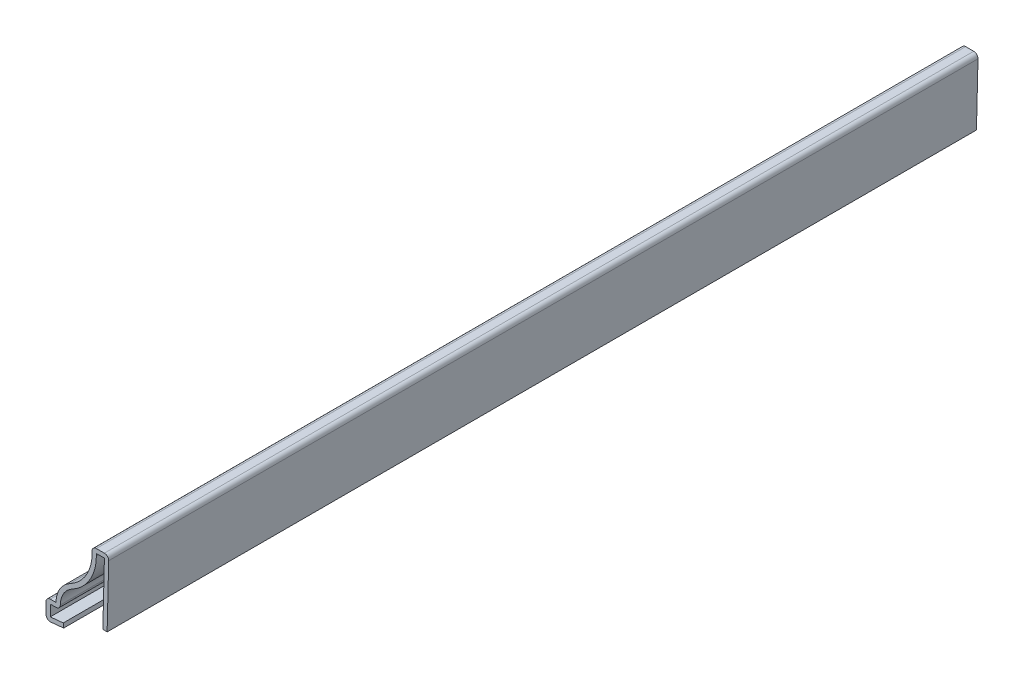
ISO-10303-21;
HEADER;
FILE_DESCRIPTION(('STEP AP214'),'2;1');
FILE_NAME('part.step','',(''),(''),'','','');
FILE_SCHEMA(('AUTOMOTIVE_DESIGN { 1 0 10303 214 1 1 1 1 }'));
ENDSEC;
DATA;
#1=APPLICATION_CONTEXT('core data for automotive mechanical design processes');
#2=APPLICATION_PROTOCOL_DEFINITION('international standard','automotive_design',2000,#1);
#3=PRODUCT_CONTEXT('',#1,'mechanical');
#4=PRODUCT('Part','Part','',(#3));
#5=PRODUCT_RELATED_PRODUCT_CATEGORY('part','',(#4));
#6=PRODUCT_DEFINITION_FORMATION('','',#4);
#7=PRODUCT_DEFINITION_CONTEXT('part definition',#1,'design');
#8=PRODUCT_DEFINITION('design','',#6,#7);
#9=PRODUCT_DEFINITION_SHAPE('','',#8);
#10=(LENGTH_UNIT() NAMED_UNIT(*) SI_UNIT(.MILLI.,.METRE.));
#11=(NAMED_UNIT(*) PLANE_ANGLE_UNIT() SI_UNIT($,.RADIAN.));
#12=(NAMED_UNIT(*) SI_UNIT($,.STERADIAN.) SOLID_ANGLE_UNIT());
#13=UNCERTAINTY_MEASURE_WITH_UNIT(LENGTH_MEASURE(1.E-05),#10,'distance_accuracy_value','');
#14=(GEOMETRIC_REPRESENTATION_CONTEXT(3) GLOBAL_UNCERTAINTY_ASSIGNED_CONTEXT((#13)) GLOBAL_UNIT_ASSIGNED_CONTEXT((#10,
#11,#12)) REPRESENTATION_CONTEXT('',''));
#15=CARTESIAN_POINT('',(0.,0.,0.));
#16=DIRECTION('',(0.,0.,1.));
#17=DIRECTION('',(1.,0.,0.));
#18=AXIS2_PLACEMENT_3D('',#15,#16,#17);
#19=CARTESIAN_POINT('',(-1.01568264875065,20.6628920662188,-206.375));
#20=DIRECTION('',(-0.999687646408123,0.0249921911602029,0.));
#21=DIRECTION('',(-0.0249921911602029,-0.999687646408123,0.));
#22=AXIS2_PLACEMENT_3D('',#19,#20,#21);
#23=PLANE('',#22);
#24=DIRECTION('',(-0.0249921911602029,-0.999687646408123,0.));
#25=VECTOR('',#24,1.);
#26=CARTESIAN_POINT('',(-1.01568264875065,20.6628920662188,0.));
#27=LINE('',#26,#25);
#28=CARTESIAN_POINT('',(-1.04171745040612,19.6215,0.));
#29=VERTEX_POINT('',#28);
#30=CARTESIAN_POINT('',(-1.41255764875065,4.78789206621876,0.));
#31=VERTEX_POINT('',#30);
#32=EDGE_CURVE('E259',#29,#31,#27,.T.);
#33=ORIENTED_EDGE('',*,*,#32,.F.);
#34=DIRECTION('',(0.,0.,1.));
#35=VECTOR('',#34,1.);
#36=CARTESIAN_POINT('',(-1.04171745040612,19.6215,-206.375));
#37=LINE('',#36,#35);
#38=CARTESIAN_POINT('',(-1.04171745040612,19.6215,-206.375));
#39=VERTEX_POINT('',#38);
#40=EDGE_CURVE('E215',#39,#29,#37,.T.);
#41=ORIENTED_EDGE('',*,*,#40,.F.);
#42=DIRECTION('',(-0.0249921911602029,-0.999687646408123,0.));
#43=VECTOR('',#42,1.);
#44=CARTESIAN_POINT('',(-1.01568264875065,20.6628920662188,-206.375));
#45=LINE('',#44,#43);
#46=CARTESIAN_POINT('',(-1.41255764875065,4.78789206621876,-206.375));
#47=VERTEX_POINT('',#46);
#48=EDGE_CURVE('E197',#39,#47,#45,.T.);
#49=ORIENTED_EDGE('',*,*,#48,.T.);
#50=DIRECTION('',(0.,0.,1.));
#51=VECTOR('',#50,1.);
#52=CARTESIAN_POINT('',(-1.41255764875065,4.78789206621876,-206.375));
#53=LINE('',#52,#51);
#54=EDGE_CURVE('E205',#47,#31,#53,.T.);
#55=ORIENTED_EDGE('',*,*,#54,.T.);
#56=EDGE_LOOP('',(#33,#41,#49,#55));
#57=FACE_BOUND('',#56,.T.);
#58=ADVANCED_FACE('F35',(#57),#23,.T.);
#59=CARTESIAN_POINT('',(0.,19.6215,-206.375));
#60=DIRECTION('',(0.,-1.,0.));
#61=DIRECTION('',(0.,0.,-1.));
#62=AXIS2_PLACEMENT_3D('',#59,#60,#61);
#63=PLANE('',#62);
#64=DIRECTION('',(1.,0.,0.));
#65=VECTOR('',#64,1.);
#66=CARTESIAN_POINT('',(0.,19.6215,0.));
#67=LINE('',#66,#65);
#68=CARTESIAN_POINT('',(-2.95275,19.6215,0.));
#69=VERTEX_POINT('',#68);
#70=EDGE_CURVE('E216',#69,#29,#67,.T.);
#71=ORIENTED_EDGE('',*,*,#70,.F.);
#72=DIRECTION('',(0.,0.,1.));
#73=VECTOR('',#72,1.);
#74=CARTESIAN_POINT('',(-2.95275,19.6215,-206.375));
#75=LINE('',#74,#73);
#76=CARTESIAN_POINT('',(-2.95275,19.6215,-206.375));
#77=VERTEX_POINT('',#76);
#78=EDGE_CURVE('E301',#77,#69,#75,.T.);
#79=ORIENTED_EDGE('',*,*,#78,.F.);
#80=DIRECTION('',(1.,0.,0.));
#81=VECTOR('',#80,1.);
#82=CARTESIAN_POINT('',(0.,19.6215,-206.375));
#83=LINE('',#82,#81);
#84=EDGE_CURVE('E213',#77,#39,#83,.T.);
#85=ORIENTED_EDGE('',*,*,#84,.T.);
#86=ORIENTED_EDGE('',*,*,#40,.T.);
#87=EDGE_LOOP('',(#71,#79,#85,#86));
#88=FACE_BOUND('',#87,.T.);
#89=ADVANCED_FACE('F387',(#88),#63,.T.);
#90=CARTESIAN_POINT('',(-2.95275,20.6375,-206.375));
#91=DIRECTION('',(1.,0.,0.));
#92=DIRECTION('',(0.,0.,-1.));
#93=AXIS2_PLACEMENT_3D('',#90,#91,#92);
#94=PLANE('',#93);
#95=DIRECTION('',(0.,1.,0.));
#96=VECTOR('',#95,1.);
#97=CARTESIAN_POINT('',(-2.95275,20.6375,0.));
#98=LINE('',#97,#96);
#99=CARTESIAN_POINT('',(-2.95275,19.05,0.));
#100=VERTEX_POINT('',#99);
#101=EDGE_CURVE('E219',#100,#69,#98,.T.);
#102=ORIENTED_EDGE('',*,*,#101,.F.);
#103=DIRECTION('',(0.,0.,1.));
#104=VECTOR('',#103,1.);
#105=CARTESIAN_POINT('',(-2.95275,19.05,-206.375));
#106=LINE('',#105,#104);
#107=CARTESIAN_POINT('',(-2.95275,19.05,-206.375));
#108=VERTEX_POINT('',#107);
#109=EDGE_CURVE('E303',#108,#100,#106,.T.);
#110=ORIENTED_EDGE('',*,*,#109,.F.);
#111=DIRECTION('',(0.,1.,0.));
#112=VECTOR('',#111,1.);
#113=CARTESIAN_POINT('',(-2.95275,20.6375,-206.375));
#114=LINE('',#113,#112);
#115=EDGE_CURVE('E255',#108,#77,#114,.T.);
#116=ORIENTED_EDGE('',*,*,#115,.T.);
#117=ORIENTED_EDGE('',*,*,#78,.T.);
#118=EDGE_LOOP('',(#102,#110,#116,#117));
#119=FACE_BOUND('',#118,.T.);
#120=ADVANCED_FACE('F463',(#119),#94,.T.);
#121=CARTESIAN_POINT('',(-13.890625,19.05,-206.375));
#122=DIRECTION('',(0.,0.,1.));
#123=DIRECTION('',(1.,0.,0.));
#124=AXIS2_PLACEMENT_3D('',#121,#122,#123);
#125=CYLINDRICAL_SURFACE('',#124,10.937875);
#126=CARTESIAN_POINT('',(-13.890625,19.05,0.));
#127=DIRECTION('',(0.,0.,1.));
#128=DIRECTION('',(1.,0.,0.));
#129=AXIS2_PLACEMENT_3D('',#126,#127,#128);
#130=CIRCLE('',#129,10.937875);
#131=CARTESIAN_POINT('',(-8.70447158536586,9.41979116137643,0.));
#132=VERTEX_POINT('',#131);
#133=EDGE_CURVE('E294',#132,#100,#130,.T.);
#134=ORIENTED_EDGE('',*,*,#133,.F.);
#135=DIRECTION('',(0.,0.,1.));
#136=VECTOR('',#135,1.);
#137=CARTESIAN_POINT('',(-8.70447158536586,9.41979116137643,-206.375));
#138=LINE('',#137,#136);
#139=CARTESIAN_POINT('',(-8.70447158536586,9.41979116137643,-206.375));
#140=VERTEX_POINT('',#139);
#141=EDGE_CURVE('E305',#140,#132,#138,.T.);
#142=ORIENTED_EDGE('',*,*,#141,.F.);
#143=CARTESIAN_POINT('',(-13.890625,19.05,-206.375));
#144=DIRECTION('',(0.,0.,1.));
#145=DIRECTION('',(1.,0.,0.));
#146=AXIS2_PLACEMENT_3D('',#143,#144,#145);
#147=CIRCLE('',#146,10.937875);
#148=EDGE_CURVE('E252',#140,#108,#147,.T.);
#149=ORIENTED_EDGE('',*,*,#148,.T.);
#150=ORIENTED_EDGE('',*,*,#109,.T.);
#151=EDGE_LOOP('',(#134,#142,#149,#150));
#152=FACE_BOUND('',#151,.T.);
#153=ADVANCED_FACE('F395',(#152),#125,.T.);
#154=CARTESIAN_POINT('',(-6.175375,4.72349193093011,-206.375));
#155=DIRECTION('',(0.,0.,1.));
#156=DIRECTION('',(1.,0.,0.));
#157=AXIS2_PLACEMENT_3D('',#154,#155,#156);
#158=CYLINDRICAL_SURFACE('',#157,5.334);
#159=CARTESIAN_POINT('',(-6.175375,4.72349193093011,0.));
#160=DIRECTION('',(0.,0.,1.));
#161=DIRECTION('',(1.,0.,0.));
#162=AXIS2_PLACEMENT_3D('',#159,#160,#161);
#163=CIRCLE('',#162,5.334);
#164=CARTESIAN_POINT('',(-11.5092743558426,4.75625870894882,0.));
#165=VERTEX_POINT('',#164);
#166=EDGE_CURVE('E292',#165,#132,#163,.F.);
#167=ORIENTED_EDGE('',*,*,#166,.F.);
#168=DIRECTION('',(0.,0.,1.));
#169=VECTOR('',#168,1.);
#170=CARTESIAN_POINT('',(-11.5092743558426,4.75625870894882,-206.375));
#171=LINE('',#170,#169);
#172=CARTESIAN_POINT('',(-11.5092743558426,4.75625870894882,-206.375));
#173=VERTEX_POINT('',#172);
#174=EDGE_CURVE('E358',#165,#173,#171,.F.);
#175=ORIENTED_EDGE('',*,*,#174,.T.);
#176=CARTESIAN_POINT('',(-6.175375,4.72349193093011,-206.375));
#177=DIRECTION('',(0.,0.,1.));
#178=DIRECTION('',(1.,0.,0.));
#179=AXIS2_PLACEMENT_3D('',#176,#177,#178);
#180=CIRCLE('',#179,5.334);
#181=EDGE_CURVE('E250',#173,#140,#180,.F.);
#182=ORIENTED_EDGE('',*,*,#181,.T.);
#183=ORIENTED_EDGE('',*,*,#141,.T.);
#184=EDGE_LOOP('',(#167,#175,#182,#183));
#185=FACE_BOUND('',#184,.T.);
#186=ADVANCED_FACE('F398',(#185),#158,.F.);
#187=CARTESIAN_POINT('',(-12.5252551855269,3.7465,-206.375));
#188=DIRECTION('',(0.,-1.,0.));
#189=DIRECTION('',(1.,0.,0.));
#190=AXIS2_PLACEMENT_3D('',#187,#188,#189);
#191=PLANE('',#190);
#192=DIRECTION('',(1.,0.,0.));
#193=VECTOR('',#192,1.);
#194=CARTESIAN_POINT('',(-12.5252551855269,3.7465,-206.375));
#195=LINE('',#194,#193);
#196=CARTESIAN_POINT('',(-13.890625,3.7465,-206.375));
#197=VERTEX_POINT('',#196);
#198=CARTESIAN_POINT('',(-12.5252551855269,3.7465,-206.375));
#199=VERTEX_POINT('',#198);
#200=EDGE_CURVE('E247',#197,#199,#195,.T.);
#201=ORIENTED_EDGE('',*,*,#200,.T.);
#202=DIRECTION('',(0.,0.,1.));
#203=VECTOR('',#202,1.);
#204=CARTESIAN_POINT('',(-12.5252551855269,3.7465,-206.375));
#205=LINE('',#204,#203);
#206=CARTESIAN_POINT('',(-12.5252551855269,3.7465,0.));
#207=VERTEX_POINT('',#206);
#208=EDGE_CURVE('E355',#199,#207,#205,.T.);
#209=ORIENTED_EDGE('',*,*,#208,.T.);
#210=DIRECTION('',(1.,0.,0.));
#211=VECTOR('',#210,1.);
#212=CARTESIAN_POINT('',(-12.5252551855269,3.7465,0.));
#213=LINE('',#212,#211);
#214=CARTESIAN_POINT('',(-13.890625,3.7465,0.));
#215=VERTEX_POINT('',#214);
#216=EDGE_CURVE('E289',#215,#207,#213,.T.);
#217=ORIENTED_EDGE('',*,*,#216,.F.);
#218=DIRECTION('',(0.,0.,1.));
#219=VECTOR('',#218,1.);
#220=CARTESIAN_POINT('',(-13.890625,3.7465,-206.375));
#221=LINE('',#220,#219);
#222=EDGE_CURVE('E308',#197,#215,#221,.T.);
#223=ORIENTED_EDGE('',*,*,#222,.F.);
#224=EDGE_LOOP('',(#201,#209,#217,#223));
#225=FACE_BOUND('',#224,.T.);
#226=ADVANCED_FACE('F407',(#225),#191,.T.);
#227=CARTESIAN_POINT('',(-13.890625,4.7625,-206.375));
#228=DIRECTION('',(1.,0.,0.));
#229=DIRECTION('',(0.,1.,0.));
#230=AXIS2_PLACEMENT_3D('',#227,#228,#229);
#231=PLANE('',#230);
#232=DIRECTION('',(0.,1.,0.));
#233=VECTOR('',#232,1.);
#234=CARTESIAN_POINT('',(-13.890625,4.7625,0.));
#235=LINE('',#234,#233);
#236=CARTESIAN_POINT('',(-13.890625,1.11675745203684,0.));
#237=VERTEX_POINT('',#236);
#238=EDGE_CURVE('E286',#237,#215,#235,.T.);
#239=ORIENTED_EDGE('',*,*,#238,.F.);
#240=DIRECTION('',(0.,0.,1.));
#241=VECTOR('',#240,1.);
#242=CARTESIAN_POINT('',(-13.890625,1.11675745203684,-206.375));
#243=LINE('',#242,#241);
#244=CARTESIAN_POINT('',(-13.890625,1.11675745203684,-206.375));
#245=VERTEX_POINT('',#244);
#246=EDGE_CURVE('E310',#245,#237,#243,.T.);
#247=ORIENTED_EDGE('',*,*,#246,.F.);
#248=DIRECTION('',(0.,1.,0.));
#249=VECTOR('',#248,1.);
#250=CARTESIAN_POINT('',(-13.890625,4.7625,-206.375));
#251=LINE('',#250,#249);
#252=EDGE_CURVE('E244',#245,#197,#251,.T.);
#253=ORIENTED_EDGE('',*,*,#252,.T.);
#254=ORIENTED_EDGE('',*,*,#222,.T.);
#255=EDGE_LOOP('',(#239,#247,#253,#254));
#256=FACE_BOUND('',#255,.T.);
#257=ADVANCED_FACE('F412',(#256),#231,.T.);
#258=CARTESIAN_POINT('',(-15.0024086092127,1.01147491328564,-206.375));
#259=DIRECTION('',(-0.0942752059179681,0.995546174493742,0.));
#260=DIRECTION('',(-0.995546174493742,-0.0942752059179681,0.));
#261=AXIS2_PLACEMENT_3D('',#258,#259,#260);
#262=PLANE('',#261);
#263=DIRECTION('',(-0.995546174493742,-0.0942752059179681,0.));
#264=VECTOR('',#263,1.);
#265=CARTESIAN_POINT('',(-15.0024086092127,1.01147491328564,0.));
#266=LINE('',#265,#264);
#267=CARTESIAN_POINT('',(-10.8114086092127,1.40834991328564,0.));
#268=VERTEX_POINT('',#267);
#269=EDGE_CURVE('E283',#268,#237,#266,.T.);
#270=ORIENTED_EDGE('',*,*,#269,.F.);
#271=DIRECTION('',(0.,0.,1.));
#272=VECTOR('',#271,1.);
#273=CARTESIAN_POINT('',(-10.8114086092127,1.40834991328564,-206.375));
#274=LINE('',#273,#272);
#275=CARTESIAN_POINT('',(-10.8114086092127,1.40834991328564,-206.375));
#276=VERTEX_POINT('',#275);
#277=EDGE_CURVE('E312',#276,#268,#274,.T.);
#278=ORIENTED_EDGE('',*,*,#277,.F.);
#279=DIRECTION('',(-0.995546174493742,-0.0942752059179681,0.));
#280=VECTOR('',#279,1.);
#281=CARTESIAN_POINT('',(-15.0024086092127,1.01147491328564,-206.375));
#282=LINE('',#281,#280);
#283=EDGE_CURVE('E241',#276,#245,#282,.T.);
#284=ORIENTED_EDGE('',*,*,#283,.T.);
#285=ORIENTED_EDGE('',*,*,#246,.T.);
#286=EDGE_LOOP('',(#270,#278,#284,#285));
#287=FACE_BOUND('',#286,.T.);
#288=ADVANCED_FACE('F416',(#287),#262,.T.);
#289=CARTESIAN_POINT('',(-10.8114086092127,1.40834991328564,-206.375));
#290=DIRECTION('',(-0.995546174493742,-0.0942752059179688,0.));
#291=DIRECTION('',(0.0942752059179689,-0.995546174493742,0.));
#292=AXIS2_PLACEMENT_3D('',#289,#290,#291);
#293=PLANE('',#292);
#294=DIRECTION('',(0.0942752059179688,-0.995546174493742,0.));
#295=VECTOR('',#294,1.);
#296=CARTESIAN_POINT('',(-10.8114086092127,1.40834991328564,0.));
#297=LINE('',#296,#295);
#298=CARTESIAN_POINT('',(-10.715625,0.396874999999999,0.));
#299=VERTEX_POINT('',#298);
#300=EDGE_CURVE('E281',#268,#299,#297,.T.);
#301=ORIENTED_EDGE('',*,*,#300,.T.);
#302=DIRECTION('',(0.,0.,1.));
#303=VECTOR('',#302,1.);
#304=CARTESIAN_POINT('',(-10.715625,0.396874999999999,-206.375));
#305=LINE('',#304,#303);
#306=CARTESIAN_POINT('',(-10.715625,0.396874999999999,-206.375));
#307=VERTEX_POINT('',#306);
#308=EDGE_CURVE('E314',#307,#299,#305,.T.);
#309=ORIENTED_EDGE('',*,*,#308,.F.);
#310=DIRECTION('',(0.0942752059179688,-0.995546174493742,0.));
#311=VECTOR('',#310,1.);
#312=CARTESIAN_POINT('',(-10.8114086092127,1.40834991328564,-206.375));
#313=LINE('',#312,#311);
#314=EDGE_CURVE('E239',#276,#307,#313,.T.);
#315=ORIENTED_EDGE('',*,*,#314,.F.);
#316=ORIENTED_EDGE('',*,*,#277,.T.);
#317=EDGE_LOOP('',(#301,#309,#315,#316));
#318=FACE_BOUND('',#317,.T.);
#319=ADVANCED_FACE('F420',(#318),#293,.F.);
#320=CARTESIAN_POINT('',(-14.906625,0.,-206.375));
#321=DIRECTION('',(-0.0942752059179681,0.995546174493742,0.));
#322=DIRECTION('',(-0.995546174493742,-0.0942752059179681,0.));
#323=AXIS2_PLACEMENT_3D('',#320,#321,#322);
#324=PLANE('',#323);
#325=DIRECTION('',(-0.995546174493742,-0.0942752059179681,0.));
#326=VECTOR('',#325,1.);
#327=CARTESIAN_POINT('',(-14.906625,0.,0.));
#328=LINE('',#327,#326);
#329=CARTESIAN_POINT('',(-13.7948413907873,0.105282538751197,0.));
#330=VERTEX_POINT('',#329);
#331=EDGE_CURVE('E278',#299,#330,#328,.T.);
#332=ORIENTED_EDGE('',*,*,#331,.T.);
#333=DIRECTION('',(0.,0.,1.));
#334=VECTOR('',#333,1.);
#335=CARTESIAN_POINT('',(-13.7948413907873,0.105282538751197,-206.375));
#336=LINE('',#335,#334);
#337=CARTESIAN_POINT('',(-13.7948413907873,0.105282538751197,-206.375));
#338=VERTEX_POINT('',#337);
#339=EDGE_CURVE('E341',#330,#338,#336,.F.);
#340=ORIENTED_EDGE('',*,*,#339,.T.);
#341=DIRECTION('',(-0.995546174493742,-0.0942752059179681,0.));
#342=VECTOR('',#341,1.);
#343=CARTESIAN_POINT('',(-14.906625,0.,-206.375));
#344=LINE('',#343,#342);
#345=EDGE_CURVE('E237',#307,#338,#344,.T.);
#346=ORIENTED_EDGE('',*,*,#345,.F.);
#347=ORIENTED_EDGE('',*,*,#308,.T.);
#348=EDGE_LOOP('',(#332,#340,#346,#347));
#349=FACE_BOUND('',#348,.T.);
#350=ADVANCED_FACE('F560',(#349),#324,.F.);
#351=CARTESIAN_POINT('',(-14.906625,4.7625,-206.375));
#352=DIRECTION('',(1.,0.,0.));
#353=DIRECTION('',(0.,1.,0.));
#354=AXIS2_PLACEMENT_3D('',#351,#352,#353);
#355=PLANE('',#354);
#356=DIRECTION('',(0.,1.,0.));
#357=VECTOR('',#356,1.);
#358=CARTESIAN_POINT('',(-14.906625,4.7625,-206.375));
#359=LINE('',#358,#357);
#360=CARTESIAN_POINT('',(-14.906625,1.11675745203684,-206.375));
#361=VERTEX_POINT('',#360);
#362=CARTESIAN_POINT('',(-14.906625,3.7465,-206.375));
#363=VERTEX_POINT('',#362);
#364=EDGE_CURVE('E234',#361,#363,#359,.T.);
#365=ORIENTED_EDGE('',*,*,#364,.F.);
#366=DIRECTION('',(0.,0.,1.));
#367=VECTOR('',#366,1.);
#368=CARTESIAN_POINT('',(-14.906625,1.11675745203684,-206.375));
#369=LINE('',#368,#367);
#370=CARTESIAN_POINT('',(-14.906625,1.11675745203684,0.));
#371=VERTEX_POINT('',#370);
#372=EDGE_CURVE('E328',#361,#371,#369,.T.);
#373=ORIENTED_EDGE('',*,*,#372,.T.);
#374=DIRECTION('',(0.,1.,0.));
#375=VECTOR('',#374,1.);
#376=CARTESIAN_POINT('',(-14.906625,4.7625,0.));
#377=LINE('',#376,#375);
#378=CARTESIAN_POINT('',(-14.906625,3.7465,0.));
#379=VERTEX_POINT('',#378);
#380=EDGE_CURVE('E275',#371,#379,#377,.T.);
#381=ORIENTED_EDGE('',*,*,#380,.T.);
#382=DIRECTION('',(0.,0.,1.));
#383=VECTOR('',#382,1.);
#384=CARTESIAN_POINT('',(-14.906625,3.7465,-206.375));
#385=LINE('',#384,#383);
#386=EDGE_CURVE('E300',#379,#363,#385,.F.);
#387=ORIENTED_EDGE('',*,*,#386,.T.);
#388=EDGE_LOOP('',(#365,#373,#381,#387));
#389=FACE_BOUND('',#388,.T.);
#390=ADVANCED_FACE('F430',(#389),#355,.F.);
#391=CARTESIAN_POINT('',(-12.5252551855269,4.7625,-206.375));
#392=DIRECTION('',(0.,-1.,0.));
#393=DIRECTION('',(1.,0.,0.));
#394=AXIS2_PLACEMENT_3D('',#391,#392,#393);
#395=PLANE('',#394);
#396=DIRECTION('',(1.,0.,0.));
#397=VECTOR('',#396,1.);
#398=CARTESIAN_POINT('',(-12.5252551855269,4.7625,-206.375));
#399=LINE('',#398,#397);
#400=CARTESIAN_POINT('',(-13.890625,4.7625,-206.375));
#401=VERTEX_POINT('',#400);
#402=CARTESIAN_POINT('',(-12.5252551855269,4.7625,-206.375));
#403=VERTEX_POINT('',#402);
#404=EDGE_CURVE('E232',#401,#403,#399,.T.);
#405=ORIENTED_EDGE('',*,*,#404,.F.);
#406=DIRECTION('',(0.,0.,1.));
#407=VECTOR('',#406,1.);
#408=CARTESIAN_POINT('',(-13.890625,4.7625,-206.375));
#409=LINE('',#408,#407);
#410=CARTESIAN_POINT('',(-13.890625,4.7625,0.));
#411=VERTEX_POINT('',#410);
#412=EDGE_CURVE('E352',#401,#411,#409,.T.);
#413=ORIENTED_EDGE('',*,*,#412,.T.);
#414=DIRECTION('',(1.,0.,0.));
#415=VECTOR('',#414,1.);
#416=CARTESIAN_POINT('',(-12.5252551855269,4.7625,0.));
#417=LINE('',#416,#415);
#418=CARTESIAN_POINT('',(-12.5252551855269,4.7625,0.));
#419=VERTEX_POINT('',#418);
#420=EDGE_CURVE('E273',#411,#419,#417,.T.);
#421=ORIENTED_EDGE('',*,*,#420,.T.);
#422=DIRECTION('',(0.,0.,1.));
#423=VECTOR('',#422,1.);
#424=CARTESIAN_POINT('',(-12.5252551855269,4.7625,-206.375));
#425=LINE('',#424,#423);
#426=EDGE_CURVE('E317',#403,#419,#425,.T.);
#427=ORIENTED_EDGE('',*,*,#426,.F.);
#428=EDGE_LOOP('',(#405,#413,#421,#427));
#429=FACE_BOUND('',#428,.T.);
#430=ADVANCED_FACE('F441',(#429),#395,.F.);
#431=CARTESIAN_POINT('',(-6.175375,4.72349193093011,-206.375));
#432=DIRECTION('',(0.,0.,1.));
#433=DIRECTION('',(1.,0.,0.));
#434=AXIS2_PLACEMENT_3D('',#431,#432,#433);
#435=CYLINDRICAL_SURFACE('',#434,6.35);
#436=CARTESIAN_POINT('',(-6.175375,4.72349193093011,0.));
#437=DIRECTION('',(0.,0.,-1.));
#438=DIRECTION('',(1.,0.,0.));
#439=AXIS2_PLACEMENT_3D('',#436,#437,#438);
#440=CIRCLE('',#439,6.35);
#441=CARTESIAN_POINT('',(-9.18620426829268,10.3143243481281,0.));
#442=VERTEX_POINT('',#441);
#443=EDGE_CURVE('E271',#419,#442,#440,.T.);
#444=ORIENTED_EDGE('',*,*,#443,.T.);
#445=DIRECTION('',(0.,0.,1.));
#446=VECTOR('',#445,1.);
#447=CARTESIAN_POINT('',(-9.18620426829268,10.3143243481281,-206.375));
#448=LINE('',#447,#446);
#449=CARTESIAN_POINT('',(-9.18620426829268,10.3143243481281,-206.375));
#450=VERTEX_POINT('',#449);
#451=EDGE_CURVE('E320',#450,#442,#448,.T.);
#452=ORIENTED_EDGE('',*,*,#451,.F.);
#453=CARTESIAN_POINT('',(-6.175375,4.72349193093011,-206.375));
#454=DIRECTION('',(0.,0.,-1.));
#455=DIRECTION('',(1.,0.,0.));
#456=AXIS2_PLACEMENT_3D('',#453,#454,#455);
#457=CIRCLE('',#456,6.35);
#458=EDGE_CURVE('E230',#403,#450,#457,.T.);
#459=ORIENTED_EDGE('',*,*,#458,.F.);
#460=ORIENTED_EDGE('',*,*,#426,.T.);
#461=EDGE_LOOP('',(#444,#452,#459,#460));
#462=FACE_BOUND('',#461,.T.);
#463=ADVANCED_FACE('F446',(#462),#435,.T.);
#464=CARTESIAN_POINT('',(-13.890625,19.05,-206.375));
#465=DIRECTION('',(0.,0.,1.));
#466=DIRECTION('',(1.,0.,0.));
#467=AXIS2_PLACEMENT_3D('',#464,#465,#466);
#468=CYLINDRICAL_SURFACE('',#467,9.921875);
#469=CARTESIAN_POINT('',(-13.890625,19.05,0.));
#470=DIRECTION('',(0.,0.,1.));
#471=DIRECTION('',(-1.,0.,0.));
#472=AXIS2_PLACEMENT_3D('',#469,#470,#471);
#473=CIRCLE('',#472,9.921875);
#474=CARTESIAN_POINT('',(-3.96875,19.05,0.));
#475=VERTEX_POINT('',#474);
#476=EDGE_CURVE('E269',#442,#475,#473,.T.);
#477=ORIENTED_EDGE('',*,*,#476,.T.);
#478=DIRECTION('',(0.,0.,1.));
#479=VECTOR('',#478,1.);
#480=CARTESIAN_POINT('',(-3.96875,19.05,-206.375));
#481=LINE('',#480,#479);
#482=CARTESIAN_POINT('',(-3.96875,19.05,-206.375));
#483=VERTEX_POINT('',#482);
#484=EDGE_CURVE('E323',#483,#475,#481,.T.);
#485=ORIENTED_EDGE('',*,*,#484,.F.);
#486=CARTESIAN_POINT('',(-13.890625,19.05,-206.375));
#487=DIRECTION('',(0.,0.,1.));
#488=DIRECTION('',(-1.,0.,0.));
#489=AXIS2_PLACEMENT_3D('',#486,#487,#488);
#490=CIRCLE('',#489,9.921875);
#491=EDGE_CURVE('E228',#450,#483,#490,.T.);
#492=ORIENTED_EDGE('',*,*,#491,.F.);
#493=ORIENTED_EDGE('',*,*,#451,.T.);
#494=EDGE_LOOP('',(#477,#485,#492,#493));
#495=FACE_BOUND('',#494,.T.);
#496=ADVANCED_FACE('F449',(#495),#468,.F.);
#497=CARTESIAN_POINT('',(-3.96875,20.6375,-206.375));
#498=DIRECTION('',(1.,0.,0.));
#499=DIRECTION('',(0.,0.,-1.));
#500=AXIS2_PLACEMENT_3D('',#497,#498,#499);
#501=PLANE('',#500);
#502=DIRECTION('',(0.,1.,0.));
#503=VECTOR('',#502,1.);
#504=CARTESIAN_POINT('',(-3.96875,20.6375,0.));
#505=LINE('',#504,#503);
#506=CARTESIAN_POINT('',(-3.96875,19.6215,0.));
#507=VERTEX_POINT('',#506);
#508=EDGE_CURVE('E266',#475,#507,#505,.T.);
#509=ORIENTED_EDGE('',*,*,#508,.T.);
#510=DIRECTION('',(0.,0.,1.));
#511=VECTOR('',#510,1.);
#512=CARTESIAN_POINT('',(-3.96875,19.6215,-206.375));
#513=LINE('',#512,#511);
#514=CARTESIAN_POINT('',(-3.96875,19.6215,-206.375));
#515=VERTEX_POINT('',#514);
#516=EDGE_CURVE('E43',#507,#515,#513,.F.);
#517=ORIENTED_EDGE('',*,*,#516,.T.);
#518=DIRECTION('',(0.,1.,0.));
#519=VECTOR('',#518,1.);
#520=CARTESIAN_POINT('',(-3.96875,20.6375,-206.375));
#521=LINE('',#520,#519);
#522=EDGE_CURVE('E225',#483,#515,#521,.T.);
#523=ORIENTED_EDGE('',*,*,#522,.F.);
#524=ORIENTED_EDGE('',*,*,#484,.T.);
#525=EDGE_LOOP('',(#509,#517,#523,#524));
#526=FACE_BOUND('',#525,.T.);
#527=ADVANCED_FACE('F366',(#526),#501,.F.);
#528=CARTESIAN_POINT('',(0.,20.6375,-206.375));
#529=DIRECTION('',(0.,-1.,0.));
#530=DIRECTION('',(0.,0.,-1.));
#531=AXIS2_PLACEMENT_3D('',#528,#529,#530);
#532=PLANE('',#531);
#533=DIRECTION('',(1.,0.,0.));
#534=VECTOR('',#533,1.);
#535=CARTESIAN_POINT('',(0.,20.6375,-206.375));
#536=LINE('',#535,#534);
#537=CARTESIAN_POINT('',(-2.95275,20.6375,-206.375));
#538=VERTEX_POINT('',#537);
#539=CARTESIAN_POINT('',(-1.04171745040612,20.6375,-206.375));
#540=VERTEX_POINT('',#539);
#541=EDGE_CURVE('E223',#538,#540,#536,.T.);
#542=ORIENTED_EDGE('',*,*,#541,.F.);
#543=DIRECTION('',(0.,0.,1.));
#544=VECTOR('',#543,1.);
#545=CARTESIAN_POINT('',(-2.95275,20.6375,-206.375));
#546=LINE('',#545,#544);
#547=CARTESIAN_POINT('',(-2.95275,20.6375,0.));
#548=VERTEX_POINT('',#547);
#549=EDGE_CURVE('E361',#538,#548,#546,.T.);
#550=ORIENTED_EDGE('',*,*,#549,.T.);
#551=DIRECTION('',(1.,0.,0.));
#552=VECTOR('',#551,1.);
#553=CARTESIAN_POINT('',(0.,20.6375,0.));
#554=LINE('',#553,#552);
#555=CARTESIAN_POINT('',(-1.04171745040612,20.6375,0.));
#556=VERTEX_POINT('',#555);
#557=EDGE_CURVE('E264',#548,#556,#554,.T.);
#558=ORIENTED_EDGE('',*,*,#557,.T.);
#559=DIRECTION('',(0.,0.,1.));
#560=VECTOR('',#559,1.);
#561=CARTESIAN_POINT('',(-1.04171745040612,20.6375,-206.375));
#562=LINE('',#561,#560);
#563=EDGE_CURVE('E58',#556,#540,#562,.F.);
#564=ORIENTED_EDGE('',*,*,#563,.T.);
#565=EDGE_LOOP('',(#542,#550,#558,#564));
#566=FACE_BOUND('',#565,.T.);
#567=ADVANCED_FACE('F375',(#566),#532,.F.);
#568=CARTESIAN_POINT('',(0.,20.6375,-206.375));
#569=DIRECTION('',(-0.999687646408123,0.0249921911602029,0.));
#570=DIRECTION('',(-0.0249921911602029,-0.999687646408123,0.));
#571=AXIS2_PLACEMENT_3D('',#568,#569,#570);
#572=PLANE('',#571);
#573=DIRECTION('',(-0.0249921911602029,-0.999687646408123,0.));
#574=VECTOR('',#573,1.);
#575=CARTESIAN_POINT('',(0.,20.6375,-206.375));
#576=LINE('',#575,#574);
#577=CARTESIAN_POINT('',(-0.026034801655469,19.5961079337812,-206.375));
#578=VERTEX_POINT('',#577);
#579=CARTESIAN_POINT('',(-0.396874999999998,4.7625,-206.375));
#580=VERTEX_POINT('',#579);
#581=EDGE_CURVE('E199',#578,#580,#576,.T.);
#582=ORIENTED_EDGE('',*,*,#581,.F.);
#583=DIRECTION('',(0.,0.,1.));
#584=VECTOR('',#583,1.);
#585=CARTESIAN_POINT('',(-0.026034801655469,19.5961079337812,-206.375));
#586=LINE('',#585,#584);
#587=CARTESIAN_POINT('',(-0.026034801655469,19.5961079337812,0.));
#588=VERTEX_POINT('',#587);
#589=EDGE_CURVE('E11',#578,#588,#586,.T.);
#590=ORIENTED_EDGE('',*,*,#589,.T.);
#591=DIRECTION('',(-0.0249921911602029,-0.999687646408123,0.));
#592=VECTOR('',#591,1.);
#593=CARTESIAN_POINT('',(0.,20.6375,0.));
#594=LINE('',#593,#592);
#595=CARTESIAN_POINT('',(-0.396874999999998,4.7625,0.));
#596=VERTEX_POINT('',#595);
#597=EDGE_CURVE('E262',#588,#596,#594,.T.);
#598=ORIENTED_EDGE('',*,*,#597,.T.);
#599=DIRECTION('',(0.,0.,1.));
#600=VECTOR('',#599,1.);
#601=CARTESIAN_POINT('',(-0.396874999999998,4.7625,-206.375));
#602=LINE('',#601,#600);
#603=EDGE_CURVE('E212',#580,#596,#602,.T.);
#604=ORIENTED_EDGE('',*,*,#603,.F.);
#605=EDGE_LOOP('',(#582,#590,#598,#604));
#606=FACE_BOUND('',#605,.T.);
#607=ADVANCED_FACE('F383',(#606),#572,.F.);
#608=CARTESIAN_POINT('',(-0.396874999999998,4.7625,-206.375));
#609=DIRECTION('',(0.0249921911601956,0.999687646408123,0.));
#610=DIRECTION('',(-0.999687646408123,0.0249921911601956,0.));
#611=AXIS2_PLACEMENT_3D('',#608,#609,#610);
#612=PLANE('',#611);
#613=DIRECTION('',(-0.999687646408123,0.0249921911601956,0.));
#614=VECTOR('',#613,1.);
#615=CARTESIAN_POINT('',(-0.396874999999998,4.7625,0.));
#616=LINE('',#615,#614);
#617=EDGE_CURVE('E208',#596,#31,#616,.T.);
#618=ORIENTED_EDGE('',*,*,#617,.T.);
#619=ORIENTED_EDGE('',*,*,#54,.F.);
#620=DIRECTION('',(-0.999687646408123,0.0249921911601956,0.));
#621=VECTOR('',#620,1.);
#622=CARTESIAN_POINT('',(-0.396874999999998,4.7625,-206.375));
#623=LINE('',#622,#621);
#624=EDGE_CURVE('E191',#580,#47,#623,.T.);
#625=ORIENTED_EDGE('',*,*,#624,.F.);
#626=ORIENTED_EDGE('',*,*,#603,.T.);
#627=EDGE_LOOP('',(#618,#619,#625,#626));
#628=FACE_BOUND('',#627,.T.);
#629=ADVANCED_FACE('F206',(#628),#612,.F.);
#630=CARTESIAN_POINT('',(-13.890625,19.05,-206.375));
#631=DIRECTION('',(0.,0.,1.));
#632=DIRECTION('',(1.,0.,0.));
#633=AXIS2_PLACEMENT_3D('',#630,#631,#632);
#634=PLANE('',#633);
#635=ORIENTED_EDGE('',*,*,#345,.T.);
#636=CARTESIAN_POINT('',(-13.890625,1.11675745203684,-206.375));
#637=DIRECTION('',(0.,0.,1.));
#638=DIRECTION('',(1.,0.,0.));
#639=AXIS2_PLACEMENT_3D('',#636,#637,#638);
#640=CIRCLE('',#639,1.016);
#641=EDGE_CURVE('E350',#338,#361,#640,.F.);
#642=ORIENTED_EDGE('',*,*,#641,.T.);
#643=ORIENTED_EDGE('',*,*,#364,.T.);
#644=CARTESIAN_POINT('',(-13.890625,3.7465,-206.375));
#645=DIRECTION('',(0.,0.,1.));
#646=DIRECTION('',(1.,0.,0.));
#647=AXIS2_PLACEMENT_3D('',#644,#645,#646);
#648=CIRCLE('',#647,1.016);
#649=EDGE_CURVE('E348',#363,#401,#648,.F.);
#650=ORIENTED_EDGE('',*,*,#649,.T.);
#651=ORIENTED_EDGE('',*,*,#404,.T.);
#652=ORIENTED_EDGE('',*,*,#458,.T.);
#653=ORIENTED_EDGE('',*,*,#491,.T.);
#654=ORIENTED_EDGE('',*,*,#522,.T.);
#655=CARTESIAN_POINT('',(-2.95275,19.6215,-206.375));
#656=DIRECTION('',(0.,0.,1.));
#657=DIRECTION('',(1.,0.,0.));
#658=AXIS2_PLACEMENT_3D('',#655,#656,#657);
#659=CIRCLE('',#658,1.016);
#660=EDGE_CURVE('E344',#515,#538,#659,.F.);
#661=ORIENTED_EDGE('',*,*,#660,.T.);
#662=ORIENTED_EDGE('',*,*,#541,.T.);
#663=CARTESIAN_POINT('',(-1.04171745040612,19.6215,-206.375));
#664=DIRECTION('',(0.,0.,1.));
#665=DIRECTION('',(1.,0.,0.));
#666=AXIS2_PLACEMENT_3D('',#663,#664,#665);
#667=CIRCLE('',#666,1.016);
#668=EDGE_CURVE('E50',#540,#578,#667,.F.);
#669=ORIENTED_EDGE('',*,*,#668,.T.);
#670=ORIENTED_EDGE('',*,*,#581,.T.);
#671=ORIENTED_EDGE('',*,*,#624,.T.);
#672=ORIENTED_EDGE('',*,*,#48,.F.);
#673=ORIENTED_EDGE('',*,*,#84,.F.);
#674=ORIENTED_EDGE('',*,*,#115,.F.);
#675=ORIENTED_EDGE('',*,*,#148,.F.);
#676=ORIENTED_EDGE('',*,*,#181,.F.);
#677=CARTESIAN_POINT('',(-12.5252551855269,4.7625,-206.375));
#678=DIRECTION('',(0.,0.,1.));
#679=DIRECTION('',(1.,0.,0.));
#680=AXIS2_PLACEMENT_3D('',#677,#678,#679);
#681=CIRCLE('',#680,1.016);
#682=EDGE_CURVE('E346',#173,#199,#681,.F.);
#683=ORIENTED_EDGE('',*,*,#682,.T.);
#684=ORIENTED_EDGE('',*,*,#200,.F.);
#685=ORIENTED_EDGE('',*,*,#252,.F.);
#686=ORIENTED_EDGE('',*,*,#283,.F.);
#687=ORIENTED_EDGE('',*,*,#314,.T.);
#688=EDGE_LOOP('',(#635,#642,#643,#650,#651,#652,#653,#654,#661,#662,#669,#670,#671,#672,#673,
#674,#675,#676,#683,#684,#685,#686,#687));
#689=FACE_BOUND('',#688,.T.);
#690=ADVANCED_FACE('F194',(#689),#634,.F.);
#691=CARTESIAN_POINT('',(-13.890625,19.05,0.));
#692=DIRECTION('',(0.,0.,1.));
#693=DIRECTION('',(1.,0.,0.));
#694=AXIS2_PLACEMENT_3D('',#691,#692,#693);
#695=PLANE('',#694);
#696=ORIENTED_EDGE('',*,*,#380,.F.);
#697=CARTESIAN_POINT('',(-13.890625,1.11675745203684,0.));
#698=DIRECTION('',(0.,0.,1.));
#699=DIRECTION('',(1.,0.,0.));
#700=AXIS2_PLACEMENT_3D('',#697,#698,#699);
#701=CIRCLE('',#700,1.016);
#702=EDGE_CURVE('E339',#371,#330,#701,.T.);
#703=ORIENTED_EDGE('',*,*,#702,.T.);
#704=ORIENTED_EDGE('',*,*,#331,.F.);
#705=ORIENTED_EDGE('',*,*,#300,.F.);
#706=ORIENTED_EDGE('',*,*,#269,.T.);
#707=ORIENTED_EDGE('',*,*,#238,.T.);
#708=ORIENTED_EDGE('',*,*,#216,.T.);
#709=CARTESIAN_POINT('',(-12.5252551855269,4.7625,0.));
#710=DIRECTION('',(0.,0.,1.));
#711=DIRECTION('',(1.,0.,0.));
#712=AXIS2_PLACEMENT_3D('',#709,#710,#711);
#713=CIRCLE('',#712,1.016);
#714=EDGE_CURVE('E335',#207,#165,#713,.T.);
#715=ORIENTED_EDGE('',*,*,#714,.T.);
#716=ORIENTED_EDGE('',*,*,#166,.T.);
#717=ORIENTED_EDGE('',*,*,#133,.T.);
#718=ORIENTED_EDGE('',*,*,#101,.T.);
#719=ORIENTED_EDGE('',*,*,#70,.T.);
#720=ORIENTED_EDGE('',*,*,#32,.T.);
#721=ORIENTED_EDGE('',*,*,#617,.F.);
#722=ORIENTED_EDGE('',*,*,#597,.F.);
#723=CARTESIAN_POINT('',(-1.04171745040612,19.6215,0.));
#724=DIRECTION('',(0.,0.,1.));
#725=DIRECTION('',(1.,0.,0.));
#726=AXIS2_PLACEMENT_3D('',#723,#724,#725);
#727=CIRCLE('',#726,1.016);
#728=EDGE_CURVE('E331',#588,#556,#727,.T.);
#729=ORIENTED_EDGE('',*,*,#728,.T.);
#730=ORIENTED_EDGE('',*,*,#557,.F.);
#731=CARTESIAN_POINT('',(-2.95275,19.6215,0.));
#732=DIRECTION('',(0.,0.,1.));
#733=DIRECTION('',(1.,0.,0.));
#734=AXIS2_PLACEMENT_3D('',#731,#732,#733);
#735=CIRCLE('',#734,1.016);
#736=EDGE_CURVE('E333',#548,#507,#735,.T.);
#737=ORIENTED_EDGE('',*,*,#736,.T.);
#738=ORIENTED_EDGE('',*,*,#508,.F.);
#739=ORIENTED_EDGE('',*,*,#476,.F.);
#740=ORIENTED_EDGE('',*,*,#443,.F.);
#741=ORIENTED_EDGE('',*,*,#420,.F.);
#742=CARTESIAN_POINT('',(-13.890625,3.7465,0.));
#743=DIRECTION('',(0.,0.,1.));
#744=DIRECTION('',(1.,0.,0.));
#745=AXIS2_PLACEMENT_3D('',#742,#743,#744);
#746=CIRCLE('',#745,1.016);
#747=EDGE_CURVE('E337',#411,#379,#746,.T.);
#748=ORIENTED_EDGE('',*,*,#747,.T.);
#749=EDGE_LOOP('',(#696,#703,#704,#705,#706,#707,#708,#715,#716,#717,#718,#719,#720,#721,#722,
#729,#730,#737,#738,#739,#740,#741,#748));
#750=FACE_BOUND('',#749,.T.);
#751=ADVANCED_FACE('F378',(#750),#695,.T.);
#752=CARTESIAN_POINT('',(-13.890625,1.11675745203684,-206.375));
#753=DIRECTION('',(0.,0.,1.));
#754=DIRECTION('',(1.,0.,0.));
#755=AXIS2_PLACEMENT_3D('',#752,#753,#754);
#756=CYLINDRICAL_SURFACE('',#755,1.016);
#757=ORIENTED_EDGE('',*,*,#641,.F.);
#758=ORIENTED_EDGE('',*,*,#339,.F.);
#759=ORIENTED_EDGE('',*,*,#702,.F.);
#760=ORIENTED_EDGE('',*,*,#372,.F.);
#761=EDGE_LOOP('',(#757,#758,#759,#760));
#762=FACE_BOUND('',#761,.T.);
#763=ADVANCED_FACE('F428',(#762),#756,.T.);
#764=CARTESIAN_POINT('',(-13.890625,3.7465,-206.375));
#765=DIRECTION('',(0.,0.,1.));
#766=DIRECTION('',(1.,0.,0.));
#767=AXIS2_PLACEMENT_3D('',#764,#765,#766);
#768=CYLINDRICAL_SURFACE('',#767,1.016);
#769=ORIENTED_EDGE('',*,*,#649,.F.);
#770=ORIENTED_EDGE('',*,*,#386,.F.);
#771=ORIENTED_EDGE('',*,*,#747,.F.);
#772=ORIENTED_EDGE('',*,*,#412,.F.);
#773=EDGE_LOOP('',(#769,#770,#771,#772));
#774=FACE_BOUND('',#773,.T.);
#775=ADVANCED_FACE('F438',(#774),#768,.T.);
#776=CARTESIAN_POINT('',(-12.5252551855269,4.7625,-206.375));
#777=DIRECTION('',(0.,0.,1.));
#778=DIRECTION('',(1.,0.,0.));
#779=AXIS2_PLACEMENT_3D('',#776,#777,#778);
#780=CYLINDRICAL_SURFACE('',#779,1.016);
#781=ORIENTED_EDGE('',*,*,#682,.F.);
#782=ORIENTED_EDGE('',*,*,#174,.F.);
#783=ORIENTED_EDGE('',*,*,#714,.F.);
#784=ORIENTED_EDGE('',*,*,#208,.F.);
#785=EDGE_LOOP('',(#781,#782,#783,#784));
#786=FACE_BOUND('',#785,.T.);
#787=ADVANCED_FACE('F404',(#786),#780,.T.);
#788=CARTESIAN_POINT('',(-2.95275,19.6215,-206.375));
#789=DIRECTION('',(0.,0.,1.));
#790=DIRECTION('',(1.,0.,0.));
#791=AXIS2_PLACEMENT_3D('',#788,#789,#790);
#792=CYLINDRICAL_SURFACE('',#791,1.016);
#793=ORIENTED_EDGE('',*,*,#660,.F.);
#794=ORIENTED_EDGE('',*,*,#516,.F.);
#795=ORIENTED_EDGE('',*,*,#736,.F.);
#796=ORIENTED_EDGE('',*,*,#549,.F.);
#797=EDGE_LOOP('',(#793,#794,#795,#796));
#798=FACE_BOUND('',#797,.T.);
#799=ADVANCED_FACE('F373',(#798),#792,.T.);
#800=CARTESIAN_POINT('',(-1.04171745040612,19.6215,-206.375));
#801=DIRECTION('',(0.,0.,1.));
#802=DIRECTION('',(1.,0.,0.));
#803=AXIS2_PLACEMENT_3D('',#800,#801,#802);
#804=CYLINDRICAL_SURFACE('',#803,1.016);
#805=ORIENTED_EDGE('',*,*,#668,.F.);
#806=ORIENTED_EDGE('',*,*,#563,.F.);
#807=ORIENTED_EDGE('',*,*,#728,.F.);
#808=ORIENTED_EDGE('',*,*,#589,.F.);
#809=EDGE_LOOP('',(#805,#806,#807,#808));
#810=FACE_BOUND('',#809,.T.);
#811=ADVANCED_FACE('F37',(#810),#804,.T.);
#812=CLOSED_SHELL('',(#58,#89,#120,#153,#186,#226,#257,#288,#319,#350,#390,#430,#463,#496,#527,
#567,#607,#629,#690,#751,#763,#775,#787,#799,#811));
#813=MANIFOLD_SOLID_BREP('B2',#812);
#814=ADVANCED_BREP_SHAPE_REPRESENTATION('',(#18,#813),#14);
#815=SHAPE_DEFINITION_REPRESENTATION(#9,#814);
ENDSEC;
END-ISO-10303-21;
